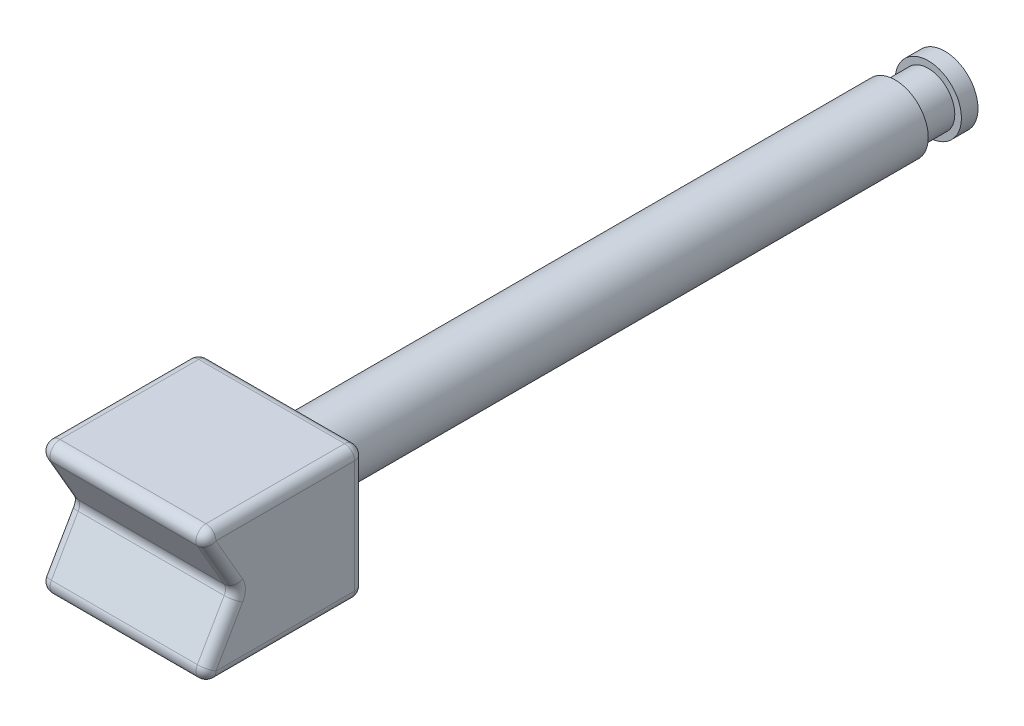
ISO-10303-21;
HEADER;
FILE_DESCRIPTION(('STEP AP214'),'2;1');
FILE_NAME('part.step','',(''),(''),'','','');
FILE_SCHEMA(('AUTOMOTIVE_DESIGN { 1 0 10303 214 1 1 1 1 }'));
ENDSEC;
DATA;
#1=APPLICATION_CONTEXT('core data for automotive mechanical design processes');
#2=APPLICATION_PROTOCOL_DEFINITION('international standard','automotive_design',2000,#1);
#3=PRODUCT_CONTEXT('',#1,'mechanical');
#4=PRODUCT('Part','Part','',(#3));
#5=PRODUCT_RELATED_PRODUCT_CATEGORY('part','',(#4));
#6=PRODUCT_DEFINITION_FORMATION('','',#4);
#7=PRODUCT_DEFINITION_CONTEXT('part definition',#1,'design');
#8=PRODUCT_DEFINITION('design','',#6,#7);
#9=PRODUCT_DEFINITION_SHAPE('','',#8);
#10=(LENGTH_UNIT() NAMED_UNIT(*) SI_UNIT(.MILLI.,.METRE.));
#11=(NAMED_UNIT(*) PLANE_ANGLE_UNIT() SI_UNIT($,.RADIAN.));
#12=(NAMED_UNIT(*) SI_UNIT($,.STERADIAN.) SOLID_ANGLE_UNIT());
#13=UNCERTAINTY_MEASURE_WITH_UNIT(LENGTH_MEASURE(1.E-05),#10,'distance_accuracy_value','');
#14=(GEOMETRIC_REPRESENTATION_CONTEXT(3) GLOBAL_UNCERTAINTY_ASSIGNED_CONTEXT((#13)) GLOBAL_UNIT_ASSIGNED_CONTEXT((#10,
#11,#12)) REPRESENTATION_CONTEXT('',''));
#15=CARTESIAN_POINT('',(0.,0.,0.));
#16=DIRECTION('',(0.,0.,1.));
#17=DIRECTION('',(1.,0.,0.));
#18=AXIS2_PLACEMENT_3D('',#15,#16,#17);
#19=CARTESIAN_POINT('',(0.,0.,-22.5));
#20=DIRECTION('',(0.,0.,1.));
#21=DIRECTION('',(1.,0.,0.));
#22=AXIS2_PLACEMENT_3D('',#19,#20,#21);
#23=CYLINDRICAL_SURFACE('',#22,1.);
#24=CARTESIAN_POINT('',(0.,0.,-2.8));
#25=DIRECTION('',(0.,0.,1.));
#26=DIRECTION('',(1.,0.,0.));
#27=AXIS2_PLACEMENT_3D('',#24,#25,#26);
#28=CIRCLE('',#27,1.);
#29=CARTESIAN_POINT('',(1.,0.,-2.8));
#30=VERTEX_POINT('',#29);
#31=EDGE_CURVE('E179',#30,#30,#28,.F.);
#32=ORIENTED_EDGE('',*,*,#31,.T.);
#33=EDGE_LOOP('',(#32));
#34=FACE_BOUND('',#33,.T.);
#35=CARTESIAN_POINT('',(0.,0.,-21.));
#36=DIRECTION('',(0.,0.,1.));
#37=DIRECTION('',(1.,0.,0.));
#38=AXIS2_PLACEMENT_3D('',#35,#36,#37);
#39=CIRCLE('',#38,1.);
#40=CARTESIAN_POINT('',(1.,0.,-21.));
#41=VERTEX_POINT('',#40);
#42=EDGE_CURVE('E279',#41,#41,#39,.T.);
#43=ORIENTED_EDGE('',*,*,#42,.T.);
#44=EDGE_LOOP('',(#43));
#45=FACE_BOUND('',#44,.T.);
#46=ADVANCED_FACE('F43',(#34,#45),#23,.T.);
#47=CARTESIAN_POINT('',(2.5,2.,2.5));
#48=DIRECTION('',(-1.,0.,0.));
#49=DIRECTION('',(0.,0.,1.));
#50=AXIS2_PLACEMENT_3D('',#47,#48,#49);
#51=PLANE('',#50);
#52=DIRECTION('',(0.,-0.866025403784438,0.500000000000001));
#53=VECTOR('',#52,1.);
#54=CARTESIAN_POINT('',(2.5,0.849999999999994,0.508141571295788));
#55=LINE('',#54,#53);
#56=CARTESIAN_POINT('',(2.5,-0.300000000000001,1.17209438086386));
#57=VERTEX_POINT('',#56);
#58=CARTESIAN_POINT('',(2.5,-1.7,1.98038475772934));
#59=VERTEX_POINT('',#58);
#60=EDGE_CURVE('E385',#57,#59,#55,.T.);
#61=ORIENTED_EDGE('',*,*,#60,.T.);
#62=DIRECTION('',(0.,0.,-1.));
#63=VECTOR('',#62,1.);
#64=CARTESIAN_POINT('',(2.5,-1.7,-2.5));
#65=LINE('',#64,#63);
#66=CARTESIAN_POINT('',(2.5,-1.7,-2.2));
#67=VERTEX_POINT('',#66);
#68=EDGE_CURVE('E388',#59,#67,#65,.T.);
#69=ORIENTED_EDGE('',*,*,#68,.T.);
#70=DIRECTION('',(0.,-1.,0.));
#71=VECTOR('',#70,1.);
#72=CARTESIAN_POINT('',(2.5,2.,-2.2));
#73=LINE('',#72,#71);
#74=CARTESIAN_POINT('',(2.5,1.7,-2.2));
#75=VERTEX_POINT('',#74);
#76=EDGE_CURVE('E378',#67,#75,#73,.F.);
#77=ORIENTED_EDGE('',*,*,#76,.T.);
#78=DIRECTION('',(0.,0.,-1.));
#79=VECTOR('',#78,1.);
#80=CARTESIAN_POINT('',(2.5,1.7,2.5));
#81=LINE('',#80,#79);
#82=CARTESIAN_POINT('',(2.5,1.7,1.98038475772934));
#83=VERTEX_POINT('',#82);
#84=EDGE_CURVE('E372',#75,#83,#81,.F.);
#85=ORIENTED_EDGE('',*,*,#84,.T.);
#86=DIRECTION('',(0.,-0.866025403784438,-0.500000000000001));
#87=VECTOR('',#86,1.);
#88=CARTESIAN_POINT('',(2.5,2.15,2.24019237886467));
#89=LINE('',#88,#87);
#90=CARTESIAN_POINT('',(2.5,0.300000000000001,1.17209438086386));
#91=VERTEX_POINT('',#90);
#92=EDGE_CURVE('E375',#83,#91,#89,.T.);
#93=ORIENTED_EDGE('',*,*,#92,.T.);
#94=CARTESIAN_POINT('',(2.5,0.,1.69170962313452));
#95=DIRECTION('',(-1.,0.,0.));
#96=DIRECTION('',(0.,0.,1.));
#97=AXIS2_PLACEMENT_3D('',#94,#95,#96);
#98=CIRCLE('',#97,0.6);
#99=EDGE_CURVE('E382',#57,#91,#98,.F.);
#100=ORIENTED_EDGE('',*,*,#99,.F.);
#101=EDGE_LOOP('',(#61,#69,#77,#85,#93,#100));
#102=FACE_BOUND('',#101,.T.);
#103=ADVANCED_FACE('F471',(#102),#51,.F.);
#104=CARTESIAN_POINT('',(-2.5,2.,-2.5));
#105=DIRECTION('',(0.,0.,1.));
#106=DIRECTION('',(1.,0.,0.));
#107=AXIS2_PLACEMENT_3D('',#104,#105,#106);
#108=PLANE('',#107);
#109=CARTESIAN_POINT('',(0.,0.,-2.5));
#110=DIRECTION('',(0.,0.,1.));
#111=DIRECTION('',(1.,0.,0.));
#112=AXIS2_PLACEMENT_3D('',#109,#110,#111);
#113=CIRCLE('',#112,1.3);
#114=CARTESIAN_POINT('',(1.3,0.,-2.5));
#115=VERTEX_POINT('',#114);
#116=EDGE_CURVE('E311',#115,#115,#113,.T.);
#117=ORIENTED_EDGE('',*,*,#116,.T.);
#118=EDGE_LOOP('',(#117));
#119=FACE_BOUND('',#118,.T.);
#120=DIRECTION('',(0.,-1.,0.));
#121=VECTOR('',#120,1.);
#122=CARTESIAN_POINT('',(2.2,2.,-2.5));
#123=LINE('',#122,#121);
#124=CARTESIAN_POINT('',(2.2,1.7,-2.5));
#125=VERTEX_POINT('',#124);
#126=CARTESIAN_POINT('',(2.2,-1.7,-2.5));
#127=VERTEX_POINT('',#126);
#128=EDGE_CURVE('E167',#125,#127,#123,.T.);
#129=ORIENTED_EDGE('',*,*,#128,.T.);
#130=DIRECTION('',(-1.,0.,0.));
#131=VECTOR('',#130,1.);
#132=CARTESIAN_POINT('',(-2.5,-1.7,-2.5));
#133=LINE('',#132,#131);
#134=CARTESIAN_POINT('',(-2.2,-1.7,-2.5));
#135=VERTEX_POINT('',#134);
#136=EDGE_CURVE('E162',#127,#135,#133,.T.);
#137=ORIENTED_EDGE('',*,*,#136,.T.);
#138=DIRECTION('',(0.,-1.,0.));
#139=VECTOR('',#138,1.);
#140=CARTESIAN_POINT('',(-2.2,2.,-2.5));
#141=LINE('',#140,#139);
#142=CARTESIAN_POINT('',(-2.2,1.7,-2.5));
#143=VERTEX_POINT('',#142);
#144=EDGE_CURVE('E156',#135,#143,#141,.F.);
#145=ORIENTED_EDGE('',*,*,#144,.T.);
#146=DIRECTION('',(-1.,0.,0.));
#147=VECTOR('',#146,1.);
#148=CARTESIAN_POINT('',(-2.5,1.7,-2.5));
#149=LINE('',#148,#147);
#150=EDGE_CURVE('E159',#143,#125,#149,.F.);
#151=ORIENTED_EDGE('',*,*,#150,.T.);
#152=EDGE_LOOP('',(#129,#137,#145,#151));
#153=FACE_BOUND('',#152,.T.);
#154=ADVANCED_FACE('F158',(#119,#153),#108,.F.);
#155=CARTESIAN_POINT('',(-2.5,2.,2.5));
#156=DIRECTION('',(1.,0.,0.));
#157=DIRECTION('',(0.,0.,-1.));
#158=AXIS2_PLACEMENT_3D('',#155,#156,#157);
#159=PLANE('',#158);
#160=DIRECTION('',(0.,-1.,0.));
#161=VECTOR('',#160,1.);
#162=CARTESIAN_POINT('',(-2.5,2.,-2.2));
#163=LINE('',#162,#161);
#164=CARTESIAN_POINT('',(-2.5,1.7,-2.2));
#165=VERTEX_POINT('',#164);
#166=CARTESIAN_POINT('',(-2.5,-1.7,-2.2));
#167=VERTEX_POINT('',#166);
#168=EDGE_CURVE('E192',#165,#167,#163,.T.);
#169=ORIENTED_EDGE('',*,*,#168,.T.);
#170=DIRECTION('',(0.,0.,1.));
#171=VECTOR('',#170,1.);
#172=CARTESIAN_POINT('',(-2.5,-1.7,2.5));
#173=LINE('',#172,#171);
#174=CARTESIAN_POINT('',(-2.5,-1.7,1.98038475772934));
#175=VERTEX_POINT('',#174);
#176=EDGE_CURVE('E343',#167,#175,#173,.T.);
#177=ORIENTED_EDGE('',*,*,#176,.T.);
#178=DIRECTION('',(0.,-0.866025403784438,0.500000000000001));
#179=VECTOR('',#178,1.);
#180=CARTESIAN_POINT('',(-2.5,0.849999999999995,0.50814157129579));
#181=LINE('',#180,#179);
#182=CARTESIAN_POINT('',(-2.5,-0.300000000000001,1.17209438086386));
#183=VERTEX_POINT('',#182);
#184=EDGE_CURVE('E340',#175,#183,#181,.F.);
#185=ORIENTED_EDGE('',*,*,#184,.T.);
#186=CARTESIAN_POINT('',(-2.5,0.,1.69170962313452));
#187=DIRECTION('',(1.,0.,0.));
#188=DIRECTION('',(0.,0.,-1.));
#189=AXIS2_PLACEMENT_3D('',#186,#187,#188);
#190=CIRCLE('',#189,0.6);
#191=CARTESIAN_POINT('',(-2.5,0.300000000000001,1.17209438086386));
#192=VERTEX_POINT('',#191);
#193=EDGE_CURVE('E336',#192,#183,#190,.F.);
#194=ORIENTED_EDGE('',*,*,#193,.F.);
#195=DIRECTION('',(0.,-0.866025403784438,-0.500000000000001));
#196=VECTOR('',#195,1.);
#197=CARTESIAN_POINT('',(-2.5,2.15,2.24019237886467));
#198=LINE('',#197,#196);
#199=CARTESIAN_POINT('',(-2.5,1.7,1.98038475772934));
#200=VERTEX_POINT('',#199);
#201=EDGE_CURVE('E331',#192,#200,#198,.F.);
#202=ORIENTED_EDGE('',*,*,#201,.T.);
#203=DIRECTION('',(0.,0.,1.));
#204=VECTOR('',#203,1.);
#205=CARTESIAN_POINT('',(-2.5,1.7,2.5));
#206=LINE('',#205,#204);
#207=EDGE_CURVE('E328',#200,#165,#206,.F.);
#208=ORIENTED_EDGE('',*,*,#207,.T.);
#209=EDGE_LOOP('',(#169,#177,#185,#194,#202,#208));
#210=FACE_BOUND('',#209,.T.);
#211=ADVANCED_FACE('F443',(#210),#159,.F.);
#212=CARTESIAN_POINT('',(0.,2.,0.));
#213=DIRECTION('',(0.,-1.,0.));
#214=DIRECTION('',(0.,0.,-1.));
#215=AXIS2_PLACEMENT_3D('',#212,#213,#214);
#216=PLANE('',#215);
#217=DIRECTION('',(0.,0.,1.));
#218=VECTOR('',#217,1.);
#219=CARTESIAN_POINT('',(-2.2,2.,0.));
#220=LINE('',#219,#218);
#221=CARTESIAN_POINT('',(-2.2,2.,-2.2));
#222=VERTEX_POINT('',#221);
#223=CARTESIAN_POINT('',(-2.2,2.,1.98038475772934));
#224=VERTEX_POINT('',#223);
#225=EDGE_CURVE('E53',#222,#224,#220,.T.);
#226=ORIENTED_EDGE('',*,*,#225,.T.);
#227=DIRECTION('',(1.,0.,0.));
#228=VECTOR('',#227,1.);
#229=CARTESIAN_POINT('',(0.,2.,1.98038475772934));
#230=LINE('',#229,#228);
#231=CARTESIAN_POINT('',(2.2,2.,1.98038475772934));
#232=VERTEX_POINT('',#231);
#233=EDGE_CURVE('E11',#224,#232,#230,.T.);
#234=ORIENTED_EDGE('',*,*,#233,.T.);
#235=DIRECTION('',(0.,0.,-1.));
#236=VECTOR('',#235,1.);
#237=CARTESIAN_POINT('',(2.2,2.,0.));
#238=LINE('',#237,#236);
#239=CARTESIAN_POINT('',(2.2,2.,-2.2));
#240=VERTEX_POINT('',#239);
#241=EDGE_CURVE('E391',#232,#240,#238,.T.);
#242=ORIENTED_EDGE('',*,*,#241,.T.);
#243=DIRECTION('',(-1.,0.,0.));
#244=VECTOR('',#243,1.);
#245=CARTESIAN_POINT('',(0.,2.,-2.2));
#246=LINE('',#245,#244);
#247=EDGE_CURVE('E64',#240,#222,#246,.T.);
#248=ORIENTED_EDGE('',*,*,#247,.T.);
#249=EDGE_LOOP('',(#226,#234,#242,#248));
#250=FACE_BOUND('',#249,.T.);
#251=ADVANCED_FACE('F458',(#250),#216,.F.);
#252=CARTESIAN_POINT('',(0.,-2.,0.));
#253=DIRECTION('',(0.,-1.,0.));
#254=DIRECTION('',(0.,0.,-1.));
#255=AXIS2_PLACEMENT_3D('',#252,#253,#254);
#256=PLANE('',#255);
#257=DIRECTION('',(0.,0.,1.));
#258=VECTOR('',#257,1.);
#259=CARTESIAN_POINT('',(-2.2,-2.,-2.5));
#260=LINE('',#259,#258);
#261=CARTESIAN_POINT('',(-2.2,-2.,1.98038475772934));
#262=VERTEX_POINT('',#261);
#263=CARTESIAN_POINT('',(-2.2,-2.,-2.2));
#264=VERTEX_POINT('',#263);
#265=EDGE_CURVE('E321',#262,#264,#260,.F.);
#266=ORIENTED_EDGE('',*,*,#265,.T.);
#267=DIRECTION('',(-1.,0.,0.));
#268=VECTOR('',#267,1.);
#269=CARTESIAN_POINT('',(2.5,-2.,-2.2));
#270=LINE('',#269,#268);
#271=CARTESIAN_POINT('',(2.2,-2.,-2.2));
#272=VERTEX_POINT('',#271);
#273=EDGE_CURVE('E324',#264,#272,#270,.F.);
#274=ORIENTED_EDGE('',*,*,#273,.T.);
#275=DIRECTION('',(0.,0.,-1.));
#276=VECTOR('',#275,1.);
#277=CARTESIAN_POINT('',(2.2,-2.,2.5));
#278=LINE('',#277,#276);
#279=CARTESIAN_POINT('',(2.2,-2.,1.98038475772934));
#280=VERTEX_POINT('',#279);
#281=EDGE_CURVE('E315',#272,#280,#278,.F.);
#282=ORIENTED_EDGE('',*,*,#281,.T.);
#283=DIRECTION('',(1.,0.,0.));
#284=VECTOR('',#283,1.);
#285=CARTESIAN_POINT('',(-2.5,-2.,1.98038475772934));
#286=LINE('',#285,#284);
#287=EDGE_CURVE('E318',#280,#262,#286,.F.);
#288=ORIENTED_EDGE('',*,*,#287,.T.);
#289=EDGE_LOOP('',(#266,#274,#282,#288));
#290=FACE_BOUND('',#289,.T.);
#291=ADVANCED_FACE('F429',(#290),#256,.T.);
#292=CARTESIAN_POINT('',(2.5,0.,1.34529946162074));
#293=DIRECTION('',(0.,-0.500000000000001,-0.866025403784438));
#294=DIRECTION('',(0.,0.866025403784438,-0.500000000000001));
#295=AXIS2_PLACEMENT_3D('',#292,#293,#294);
#296=PLANE('',#295);
#297=DIRECTION('',(-1.,0.,0.));
#298=VECTOR('',#297,1.);
#299=CARTESIAN_POINT('',(-2.5,-0.150000000000001,1.43190200199919));
#300=LINE('',#299,#298);
#301=CARTESIAN_POINT('',(2.2,-0.150000000000001,1.43190200199919));
#302=VERTEX_POINT('',#301);
#303=CARTESIAN_POINT('',(-2.2,-0.150000000000001,1.43190200199919));
#304=VERTEX_POINT('',#303);
#305=EDGE_CURVE('E365',#302,#304,#300,.T.);
#306=ORIENTED_EDGE('',*,*,#305,.T.);
#307=DIRECTION('',(0.,-0.866025403784438,0.500000000000001));
#308=VECTOR('',#307,1.);
#309=CARTESIAN_POINT('',(-2.2,0.,1.34529946162075));
#310=LINE('',#309,#308);
#311=CARTESIAN_POINT('',(-2.2,-1.55,2.24019237886467));
#312=VERTEX_POINT('',#311);
#313=EDGE_CURVE('E369',#304,#312,#310,.T.);
#314=ORIENTED_EDGE('',*,*,#313,.T.);
#315=DIRECTION('',(1.,0.,0.));
#316=VECTOR('',#315,1.);
#317=CARTESIAN_POINT('',(2.5,-1.55,2.24019237886467));
#318=LINE('',#317,#316);
#319=CARTESIAN_POINT('',(2.2,-1.55,2.24019237886467));
#320=VERTEX_POINT('',#319);
#321=EDGE_CURVE('E362',#312,#320,#318,.T.);
#322=ORIENTED_EDGE('',*,*,#321,.T.);
#323=DIRECTION('',(0.,-0.866025403784438,0.500000000000001));
#324=VECTOR('',#323,1.);
#325=CARTESIAN_POINT('',(2.2,0.,1.34529946162074));
#326=LINE('',#325,#324);
#327=EDGE_CURVE('E359',#320,#302,#326,.F.);
#328=ORIENTED_EDGE('',*,*,#327,.T.);
#329=EDGE_LOOP('',(#306,#314,#322,#328));
#330=FACE_BOUND('',#329,.T.);
#331=ADVANCED_FACE('F561',(#330),#296,.F.);
#332=CARTESIAN_POINT('',(2.5,2.,2.5));
#333=DIRECTION('',(0.,0.500000000000001,-0.866025403784438));
#334=DIRECTION('',(0.,0.866025403784438,0.500000000000001));
#335=AXIS2_PLACEMENT_3D('',#332,#333,#334);
#336=PLANE('',#335);
#337=DIRECTION('',(1.,0.,0.));
#338=VECTOR('',#337,1.);
#339=CARTESIAN_POINT('',(2.5,1.55,2.24019237886467));
#340=LINE('',#339,#338);
#341=CARTESIAN_POINT('',(2.2,1.55,2.24019237886467));
#342=VERTEX_POINT('',#341);
#343=CARTESIAN_POINT('',(-2.2,1.55,2.24019237886467));
#344=VERTEX_POINT('',#343);
#345=EDGE_CURVE('E346',#342,#344,#340,.F.);
#346=ORIENTED_EDGE('',*,*,#345,.T.);
#347=DIRECTION('',(0.,-0.866025403784438,-0.500000000000001));
#348=VECTOR('',#347,1.);
#349=CARTESIAN_POINT('',(-2.2,2.,2.5));
#350=LINE('',#349,#348);
#351=CARTESIAN_POINT('',(-2.2,0.15,1.43190200199919));
#352=VERTEX_POINT('',#351);
#353=EDGE_CURVE('E355',#344,#352,#350,.T.);
#354=ORIENTED_EDGE('',*,*,#353,.T.);
#355=DIRECTION('',(-1.,0.,0.));
#356=VECTOR('',#355,1.);
#357=CARTESIAN_POINT('',(2.5,0.15,1.43190200199919));
#358=LINE('',#357,#356);
#359=CARTESIAN_POINT('',(2.2,0.15,1.43190200199919));
#360=VERTEX_POINT('',#359);
#361=EDGE_CURVE('E352',#352,#360,#358,.F.);
#362=ORIENTED_EDGE('',*,*,#361,.T.);
#363=DIRECTION('',(0.,-0.866025403784438,-0.500000000000001));
#364=VECTOR('',#363,1.);
#365=CARTESIAN_POINT('',(2.2,2.,2.5));
#366=LINE('',#365,#364);
#367=EDGE_CURVE('E349',#360,#342,#366,.F.);
#368=ORIENTED_EDGE('',*,*,#367,.T.);
#369=EDGE_LOOP('',(#346,#354,#362,#368));
#370=FACE_BOUND('',#369,.T.);
#371=ADVANCED_FACE('F504',(#370),#336,.F.);
#372=CARTESIAN_POINT('',(0.,1.,-21.));
#373=DIRECTION('',(0.,0.,-1.));
#374=DIRECTION('',(-1.,0.,0.));
#375=AXIS2_PLACEMENT_3D('',#372,#373,#374);
#376=PLANE('',#375);
#377=CARTESIAN_POINT('',(0.,0.,-21.));
#378=DIRECTION('',(0.,0.,1.));
#379=DIRECTION('',(1.,0.,0.));
#380=AXIS2_PLACEMENT_3D('',#377,#378,#379);
#381=CIRCLE('',#380,0.8);
#382=CARTESIAN_POINT('',(0.8,0.,-21.));
#383=VERTEX_POINT('',#382);
#384=EDGE_CURVE('E296',#383,#383,#381,.T.);
#385=ORIENTED_EDGE('',*,*,#384,.T.);
#386=EDGE_LOOP('',(#385));
#387=FACE_BOUND('',#386,.T.);
#388=ORIENTED_EDGE('',*,*,#42,.F.);
#389=EDGE_LOOP('',(#388));
#390=FACE_BOUND('',#389,.T.);
#391=ADVANCED_FACE('F551',(#387,#390),#376,.T.);
#392=CARTESIAN_POINT('',(0.,0.,-23.5));
#393=DIRECTION('',(0.,0.,1.));
#394=DIRECTION('',(1.,0.,0.));
#395=AXIS2_PLACEMENT_3D('',#392,#393,#394);
#396=CYLINDRICAL_SURFACE('',#395,0.8);
#397=CARTESIAN_POINT('',(0.,0.,-22.));
#398=DIRECTION('',(0.,0.,1.));
#399=DIRECTION('',(1.,0.,0.));
#400=AXIS2_PLACEMENT_3D('',#397,#398,#399);
#401=CIRCLE('',#400,0.8);
#402=CARTESIAN_POINT('',(0.8,0.,-22.));
#403=VERTEX_POINT('',#402);
#404=EDGE_CURVE('E290',#403,#403,#401,.T.);
#405=ORIENTED_EDGE('',*,*,#404,.T.);
#406=EDGE_LOOP('',(#405));
#407=FACE_BOUND('',#406,.T.);
#408=ORIENTED_EDGE('',*,*,#384,.F.);
#409=EDGE_LOOP('',(#408));
#410=FACE_BOUND('',#409,.T.);
#411=ADVANCED_FACE('F545',(#407,#410),#396,.T.);
#412=CARTESIAN_POINT('',(0.,0.999999999999999,-22.));
#413=DIRECTION('',(0.,0.,1.));
#414=DIRECTION('',(1.,0.,0.));
#415=AXIS2_PLACEMENT_3D('',#412,#413,#414);
#416=PLANE('',#415);
#417=CARTESIAN_POINT('',(0.,0.,-22.));
#418=DIRECTION('',(0.,0.,1.));
#419=DIRECTION('',(1.,0.,0.));
#420=AXIS2_PLACEMENT_3D('',#417,#418,#419);
#421=CIRCLE('',#420,0.999999999999999);
#422=CARTESIAN_POINT('',(0.999999999999999,0.,-22.));
#423=VERTEX_POINT('',#422);
#424=EDGE_CURVE('E284',#423,#423,#421,.T.);
#425=ORIENTED_EDGE('',*,*,#424,.T.);
#426=EDGE_LOOP('',(#425));
#427=FACE_BOUND('',#426,.T.);
#428=ORIENTED_EDGE('',*,*,#404,.F.);
#429=EDGE_LOOP('',(#428));
#430=FACE_BOUND('',#429,.T.);
#431=ADVANCED_FACE('F537',(#427,#430),#416,.T.);
#432=CARTESIAN_POINT('',(0.,0.,-22.5));
#433=DIRECTION('',(0.,0.,-1.));
#434=DIRECTION('',(-1.,0.,0.));
#435=AXIS2_PLACEMENT_3D('',#432,#433,#434);
#436=PLANE('',#435);
#437=CARTESIAN_POINT('',(0.,0.,-22.5));
#438=DIRECTION('',(0.,0.,-1.));
#439=DIRECTION('',(-1.,0.,0.));
#440=AXIS2_PLACEMENT_3D('',#437,#438,#439);
#441=CIRCLE('',#440,1.);
#442=CARTESIAN_POINT('',(-1.,0.,-22.5));
#443=VERTEX_POINT('',#442);
#444=EDGE_CURVE('E300',#443,#443,#441,.T.);
#445=ORIENTED_EDGE('',*,*,#444,.T.);
#446=EDGE_LOOP('',(#445));
#447=FACE_BOUND('',#446,.T.);
#448=ADVANCED_FACE('F529',(#447),#436,.T.);
#449=ORIENTED_EDGE('',*,*,#444,.F.);
#450=EDGE_LOOP('',(#449));
#451=FACE_BOUND('',#450,.T.);
#452=ORIENTED_EDGE('',*,*,#424,.F.);
#453=EDGE_LOOP('',(#452));
#454=FACE_BOUND('',#453,.T.);
#455=ADVANCED_FACE('F520',(#451,#454),#23,.T.);
#456=CARTESIAN_POINT('',(0.,0.,-2.8));
#457=DIRECTION('',(0.,0.,1.));
#458=DIRECTION('',(1.,0.,0.));
#459=AXIS2_PLACEMENT_3D('',#456,#457,#458);
#460=TOROIDAL_SURFACE('',#459,1.3,0.3);
#461=ORIENTED_EDGE('',*,*,#116,.F.);
#462=EDGE_LOOP('',(#461));
#463=FACE_BOUND('',#462,.T.);
#464=ORIENTED_EDGE('',*,*,#31,.F.);
#465=EDGE_LOOP('',(#464));
#466=FACE_BOUND('',#465,.T.);
#467=ADVANCED_FACE('F528',(#463,#466),#460,.F.);
#468=CARTESIAN_POINT('',(2.2,2.15,2.24019237886467));
#469=DIRECTION('',(0.,-0.866025403784438,-0.500000000000001));
#470=DIRECTION('',(0.,0.500000000000001,-0.866025403784438));
#471=AXIS2_PLACEMENT_3D('',#468,#469,#470);
#472=CYLINDRICAL_SURFACE('',#471,0.3);
#473=CARTESIAN_POINT('',(2.2,1.7,1.98038475772934));
#474=DIRECTION('',(0.,0.866025403784438,0.500000000000001));
#475=DIRECTION('',(0.,-0.500000000000001,0.866025403784438));
#476=AXIS2_PLACEMENT_3D('',#473,#474,#475);
#477=CIRCLE('',#476,0.3);
#478=EDGE_CURVE('E268',#342,#83,#477,.T.);
#479=ORIENTED_EDGE('',*,*,#478,.F.);
#480=ORIENTED_EDGE('',*,*,#367,.F.);
#481=CARTESIAN_POINT('',(2.2,0.300000000000001,1.17209438086386));
#482=DIRECTION('',(0.,-0.866025403784438,-0.500000000000001));
#483=DIRECTION('',(0.,0.500000000000001,-0.866025403784438));
#484=AXIS2_PLACEMENT_3D('',#481,#482,#483);
#485=CIRCLE('',#484,0.3);
#486=EDGE_CURVE('E271',#91,#360,#485,.T.);
#487=ORIENTED_EDGE('',*,*,#486,.F.);
#488=ORIENTED_EDGE('',*,*,#92,.F.);
#489=EDGE_LOOP('',(#479,#480,#487,#488));
#490=FACE_BOUND('',#489,.T.);
#491=ADVANCED_FACE('F45',(#490),#472,.T.);
#492=CARTESIAN_POINT('',(0.,1.7,1.98038475772934));
#493=DIRECTION('',(1.,0.,0.));
#494=DIRECTION('',(0.,0.,-1.));
#495=AXIS2_PLACEMENT_3D('',#492,#493,#494);
#496=CYLINDRICAL_SURFACE('',#495,0.3);
#497=CARTESIAN_POINT('',(-2.2,1.7,1.98038475772934));
#498=DIRECTION('',(-1.,0.,0.));
#499=DIRECTION('',(0.,-1.,0.));
#500=AXIS2_PLACEMENT_3D('',#497,#498,#499);
#501=CIRCLE('',#500,0.3);
#502=EDGE_CURVE('E260',#344,#224,#501,.T.);
#503=ORIENTED_EDGE('',*,*,#502,.F.);
#504=ORIENTED_EDGE('',*,*,#345,.F.);
#505=CARTESIAN_POINT('',(2.2,1.7,1.98038475772934));
#506=DIRECTION('',(1.,0.,0.));
#507=DIRECTION('',(0.,0.,-1.));
#508=AXIS2_PLACEMENT_3D('',#505,#506,#507);
#509=CIRCLE('',#508,0.3);
#510=EDGE_CURVE('E264',#232,#342,#509,.T.);
#511=ORIENTED_EDGE('',*,*,#510,.F.);
#512=ORIENTED_EDGE('',*,*,#233,.F.);
#513=EDGE_LOOP('',(#503,#504,#511,#512));
#514=FACE_BOUND('',#513,.T.);
#515=ADVANCED_FACE('F455',(#514),#496,.T.);
#516=CARTESIAN_POINT('',(-2.2,2.15,2.24019237886467));
#517=DIRECTION('',(0.,-0.866025403784438,-0.500000000000001));
#518=DIRECTION('',(0.,0.500000000000001,-0.866025403784438));
#519=AXIS2_PLACEMENT_3D('',#516,#517,#518);
#520=CYLINDRICAL_SURFACE('',#519,0.3);
#521=CARTESIAN_POINT('',(-2.2,0.300000000000001,1.17209438086386));
#522=DIRECTION('',(0.,-0.866025403784438,-0.500000000000001));
#523=DIRECTION('',(0.,0.500000000000001,-0.866025403784438));
#524=AXIS2_PLACEMENT_3D('',#521,#522,#523);
#525=CIRCLE('',#524,0.3);
#526=EDGE_CURVE('E252',#352,#192,#525,.T.);
#527=ORIENTED_EDGE('',*,*,#526,.F.);
#528=ORIENTED_EDGE('',*,*,#353,.F.);
#529=CARTESIAN_POINT('',(-2.2,1.7,1.98038475772934));
#530=DIRECTION('',(0.,0.866025403784438,0.500000000000001));
#531=DIRECTION('',(0.,-0.500000000000001,0.866025403784438));
#532=AXIS2_PLACEMENT_3D('',#529,#530,#531);
#533=CIRCLE('',#532,0.3);
#534=EDGE_CURVE('E256',#200,#344,#533,.T.);
#535=ORIENTED_EDGE('',*,*,#534,.F.);
#536=ORIENTED_EDGE('',*,*,#201,.F.);
#537=EDGE_LOOP('',(#527,#528,#535,#536));
#538=FACE_BOUND('',#537,.T.);
#539=ADVANCED_FACE('F498',(#538),#520,.T.);
#540=CARTESIAN_POINT('',(2.5,0.,1.69170962313452));
#541=DIRECTION('',(1.,0.,0.));
#542=DIRECTION('',(0.,0.,-1.));
#543=AXIS2_PLACEMENT_3D('',#540,#541,#542);
#544=CYLINDRICAL_SURFACE('',#543,0.3);
#545=CARTESIAN_POINT('',(2.2,0.,1.69170962313452));
#546=DIRECTION('',(-1.,0.,0.));
#547=DIRECTION('',(0.,0.,1.));
#548=AXIS2_PLACEMENT_3D('',#545,#546,#547);
#549=CIRCLE('',#548,0.3);
#550=EDGE_CURVE('E47',#360,#302,#549,.T.);
#551=ORIENTED_EDGE('',*,*,#550,.F.);
#552=ORIENTED_EDGE('',*,*,#361,.F.);
#553=CARTESIAN_POINT('',(-2.2,0.,1.69170962313452));
#554=DIRECTION('',(1.,0.,0.));
#555=DIRECTION('',(0.,0.,-1.));
#556=AXIS2_PLACEMENT_3D('',#553,#554,#555);
#557=CIRCLE('',#556,0.3);
#558=EDGE_CURVE('E249',#304,#352,#557,.T.);
#559=ORIENTED_EDGE('',*,*,#558,.F.);
#560=ORIENTED_EDGE('',*,*,#305,.F.);
#561=EDGE_LOOP('',(#551,#552,#559,#560));
#562=FACE_BOUND('',#561,.T.);
#563=ADVANCED_FACE('F500',(#562),#544,.F.);
#564=CARTESIAN_POINT('',(2.2,0.,1.69170962313452));
#565=DIRECTION('',(-1.,0.,0.));
#566=DIRECTION('',(0.,0.,1.));
#567=AXIS2_PLACEMENT_3D('',#564,#565,#566);
#568=TOROIDAL_SURFACE('',#567,0.6,0.3);
#569=ORIENTED_EDGE('',*,*,#486,.T.);
#570=ORIENTED_EDGE('',*,*,#550,.T.);
#571=CARTESIAN_POINT('',(2.2,-0.300000000000001,1.17209438086386));
#572=DIRECTION('',(0.,0.866025403784438,-0.500000000000001));
#573=DIRECTION('',(0.,0.500000000000001,0.866025403784438));
#574=AXIS2_PLACEMENT_3D('',#571,#572,#573);
#575=CIRCLE('',#574,0.3);
#576=EDGE_CURVE('E245',#57,#302,#575,.F.);
#577=ORIENTED_EDGE('',*,*,#576,.F.);
#578=ORIENTED_EDGE('',*,*,#99,.T.);
#579=EDGE_LOOP('',(#569,#570,#577,#578));
#580=FACE_BOUND('',#579,.T.);
#581=ADVANCED_FACE('F509',(#580),#568,.T.);
#582=CARTESIAN_POINT('',(2.2,1.7,1.98038475772934));
#583=DIRECTION('',(1.,0.,0.));
#584=DIRECTION('',(0.,0.,-1.));
#585=AXIS2_PLACEMENT_3D('',#582,#583,#584);
#586=SPHERICAL_SURFACE('',#585,0.3);
#587=ORIENTED_EDGE('',*,*,#510,.T.);
#588=ORIENTED_EDGE('',*,*,#478,.T.);
#589=CARTESIAN_POINT('',(2.2,1.7,1.98038475772934));
#590=DIRECTION('',(0.,0.,1.));
#591=DIRECTION('',(1.,0.,0.));
#592=AXIS2_PLACEMENT_3D('',#589,#590,#591);
#593=CIRCLE('',#592,0.3);
#594=EDGE_CURVE('E241',#232,#83,#593,.F.);
#595=ORIENTED_EDGE('',*,*,#594,.F.);
#596=EDGE_LOOP('',(#587,#588,#595));
#597=FACE_BOUND('',#596,.T.);
#598=ADVANCED_FACE('F507',(#597),#586,.T.);
#599=CARTESIAN_POINT('',(-2.2,1.7,1.98038475772934));
#600=DIRECTION('',(-1.,0.,0.));
#601=DIRECTION('',(0.,0.,1.));
#602=AXIS2_PLACEMENT_3D('',#599,#600,#601);
#603=SPHERICAL_SURFACE('',#602,0.3);
#604=ORIENTED_EDGE('',*,*,#534,.T.);
#605=ORIENTED_EDGE('',*,*,#502,.T.);
#606=CARTESIAN_POINT('',(-2.2,1.7,1.98038475772934));
#607=DIRECTION('',(0.,0.,1.));
#608=DIRECTION('',(1.,0.,0.));
#609=AXIS2_PLACEMENT_3D('',#606,#607,#608);
#610=CIRCLE('',#609,0.3);
#611=EDGE_CURVE('E237',#200,#224,#610,.F.);
#612=ORIENTED_EDGE('',*,*,#611,.F.);
#613=EDGE_LOOP('',(#604,#605,#612));
#614=FACE_BOUND('',#613,.T.);
#615=ADVANCED_FACE('F451',(#614),#603,.T.);
#616=CARTESIAN_POINT('',(-2.2,0.,1.69170962313452));
#617=DIRECTION('',(1.,0.,0.));
#618=DIRECTION('',(0.,0.,-1.));
#619=AXIS2_PLACEMENT_3D('',#616,#617,#618);
#620=TOROIDAL_SURFACE('',#619,0.6,0.3);
#621=ORIENTED_EDGE('',*,*,#526,.T.);
#622=ORIENTED_EDGE('',*,*,#193,.T.);
#623=CARTESIAN_POINT('',(-2.2,-0.300000000000001,1.17209438086386));
#624=DIRECTION('',(0.,0.866025403784438,-0.500000000000002));
#625=DIRECTION('',(0.,0.500000000000002,0.866025403784438));
#626=AXIS2_PLACEMENT_3D('',#623,#624,#625);
#627=CIRCLE('',#626,0.3);
#628=EDGE_CURVE('E233',#304,#183,#627,.F.);
#629=ORIENTED_EDGE('',*,*,#628,.F.);
#630=ORIENTED_EDGE('',*,*,#558,.T.);
#631=EDGE_LOOP('',(#621,#622,#629,#630));
#632=FACE_BOUND('',#631,.T.);
#633=ADVANCED_FACE('F492',(#632),#620,.T.);
#634=CARTESIAN_POINT('',(2.2,0.849999999999994,0.508141571295789));
#635=DIRECTION('',(0.,-0.866025403784438,0.500000000000001));
#636=DIRECTION('',(0.,-0.500000000000001,-0.866025403784438));
#637=AXIS2_PLACEMENT_3D('',#634,#635,#636);
#638=CYLINDRICAL_SURFACE('',#637,0.3);
#639=ORIENTED_EDGE('',*,*,#576,.T.);
#640=ORIENTED_EDGE('',*,*,#327,.F.);
#641=CARTESIAN_POINT('',(2.2,-1.7,1.98038475772934));
#642=DIRECTION('',(0.,-0.866025403784438,0.500000000000001));
#643=DIRECTION('',(0.,-0.500000000000001,-0.866025403784438));
#644=AXIS2_PLACEMENT_3D('',#641,#642,#643);
#645=CIRCLE('',#644,0.3);
#646=EDGE_CURVE('E225',#59,#320,#645,.T.);
#647=ORIENTED_EDGE('',*,*,#646,.F.);
#648=ORIENTED_EDGE('',*,*,#60,.F.);
#649=EDGE_LOOP('',(#639,#640,#647,#648));
#650=FACE_BOUND('',#649,.T.);
#651=ADVANCED_FACE('F477',(#650),#638,.T.);
#652=CARTESIAN_POINT('',(2.2,1.7,0.));
#653=DIRECTION('',(0.,0.,-1.));
#654=DIRECTION('',(-1.,0.,0.));
#655=AXIS2_PLACEMENT_3D('',#652,#653,#654);
#656=CYLINDRICAL_SURFACE('',#655,0.3);
#657=ORIENTED_EDGE('',*,*,#594,.T.);
#658=ORIENTED_EDGE('',*,*,#84,.F.);
#659=CARTESIAN_POINT('',(2.2,1.7,-2.2));
#660=DIRECTION('',(0.,0.,-1.));
#661=DIRECTION('',(-1.,0.,0.));
#662=AXIS2_PLACEMENT_3D('',#659,#660,#661);
#663=CIRCLE('',#662,0.3);
#664=EDGE_CURVE('E221',#240,#75,#663,.T.);
#665=ORIENTED_EDGE('',*,*,#664,.F.);
#666=ORIENTED_EDGE('',*,*,#241,.F.);
#667=EDGE_LOOP('',(#657,#658,#665,#666));
#668=FACE_BOUND('',#667,.T.);
#669=ADVANCED_FACE('F463',(#668),#656,.T.);
#670=CARTESIAN_POINT('',(0.,1.7,-2.2));
#671=DIRECTION('',(-1.,0.,0.));
#672=DIRECTION('',(0.,0.,1.));
#673=AXIS2_PLACEMENT_3D('',#670,#671,#672);
#674=CYLINDRICAL_SURFACE('',#673,0.3);
#675=CARTESIAN_POINT('',(-2.2,1.7,-2.2));
#676=DIRECTION('',(-1.,0.,0.));
#677=DIRECTION('',(0.,0.,1.));
#678=AXIS2_PLACEMENT_3D('',#675,#676,#677);
#679=CIRCLE('',#678,0.3);
#680=EDGE_CURVE('E173',#222,#143,#679,.T.);
#681=ORIENTED_EDGE('',*,*,#680,.F.);
#682=ORIENTED_EDGE('',*,*,#247,.F.);
#683=CARTESIAN_POINT('',(2.2,1.7,-2.2));
#684=DIRECTION('',(1.,0.,0.));
#685=DIRECTION('',(0.,0.,-1.));
#686=AXIS2_PLACEMENT_3D('',#683,#684,#685);
#687=CIRCLE('',#686,0.3);
#688=EDGE_CURVE('E176',#125,#240,#687,.T.);
#689=ORIENTED_EDGE('',*,*,#688,.F.);
#690=ORIENTED_EDGE('',*,*,#150,.F.);
#691=EDGE_LOOP('',(#681,#682,#689,#690));
#692=FACE_BOUND('',#691,.T.);
#693=ADVANCED_FACE('F172',(#692),#674,.T.);
#694=CARTESIAN_POINT('',(-2.2,1.7,0.));
#695=DIRECTION('',(0.,0.,1.));
#696=DIRECTION('',(1.,0.,0.));
#697=AXIS2_PLACEMENT_3D('',#694,#695,#696);
#698=CYLINDRICAL_SURFACE('',#697,0.3);
#699=ORIENTED_EDGE('',*,*,#611,.T.);
#700=ORIENTED_EDGE('',*,*,#225,.F.);
#701=CARTESIAN_POINT('',(-2.2,1.7,-2.2));
#702=DIRECTION('',(0.,0.,-1.));
#703=DIRECTION('',(-1.,0.,0.));
#704=AXIS2_PLACEMENT_3D('',#701,#702,#703);
#705=CIRCLE('',#704,0.3);
#706=EDGE_CURVE('E187',#165,#222,#705,.T.);
#707=ORIENTED_EDGE('',*,*,#706,.F.);
#708=ORIENTED_EDGE('',*,*,#207,.F.);
#709=EDGE_LOOP('',(#699,#700,#707,#708));
#710=FACE_BOUND('',#709,.T.);
#711=ADVANCED_FACE('F448',(#710),#698,.T.);
#712=CARTESIAN_POINT('',(-2.2,-0.15,1.08549184048541));
#713=DIRECTION('',(0.,-0.866025403784438,0.500000000000001));
#714=DIRECTION('',(0.,-0.500000000000001,-0.866025403784438));
#715=AXIS2_PLACEMENT_3D('',#712,#713,#714);
#716=CYLINDRICAL_SURFACE('',#715,0.3);
#717=ORIENTED_EDGE('',*,*,#628,.T.);
#718=ORIENTED_EDGE('',*,*,#184,.F.);
#719=CARTESIAN_POINT('',(-2.2,-1.7,1.98038475772934));
#720=DIRECTION('',(0.,-0.866025403784438,0.500000000000001));
#721=DIRECTION('',(0.,-0.500000000000001,-0.866025403784438));
#722=AXIS2_PLACEMENT_3D('',#719,#720,#721);
#723=CIRCLE('',#722,0.3);
#724=EDGE_CURVE('E213',#312,#175,#723,.T.);
#725=ORIENTED_EDGE('',*,*,#724,.F.);
#726=ORIENTED_EDGE('',*,*,#313,.F.);
#727=EDGE_LOOP('',(#717,#718,#725,#726));
#728=FACE_BOUND('',#727,.T.);
#729=ADVANCED_FACE('F489',(#728),#716,.T.);
#730=CARTESIAN_POINT('',(2.5,-1.7,1.98038475772934));
#731=DIRECTION('',(-1.,0.,0.));
#732=DIRECTION('',(0.,0.,1.));
#733=AXIS2_PLACEMENT_3D('',#730,#731,#732);
#734=CYLINDRICAL_SURFACE('',#733,0.3);
#735=CARTESIAN_POINT('',(2.2,-1.7,1.98038475772934));
#736=DIRECTION('',(1.,0.,0.));
#737=DIRECTION('',(0.,1.,0.));
#738=AXIS2_PLACEMENT_3D('',#735,#736,#737);
#739=CIRCLE('',#738,0.3);
#740=EDGE_CURVE('E229',#320,#280,#739,.T.);
#741=ORIENTED_EDGE('',*,*,#740,.F.);
#742=ORIENTED_EDGE('',*,*,#321,.F.);
#743=CARTESIAN_POINT('',(-2.2,-1.7,1.98038475772934));
#744=DIRECTION('',(-1.,0.,0.));
#745=DIRECTION('',(0.,0.,1.));
#746=AXIS2_PLACEMENT_3D('',#743,#744,#745);
#747=CIRCLE('',#746,0.3);
#748=EDGE_CURVE('E209',#262,#312,#747,.T.);
#749=ORIENTED_EDGE('',*,*,#748,.F.);
#750=ORIENTED_EDGE('',*,*,#287,.F.);
#751=EDGE_LOOP('',(#741,#742,#749,#750));
#752=FACE_BOUND('',#751,.T.);
#753=ADVANCED_FACE('F483',(#752),#734,.T.);
#754=CARTESIAN_POINT('',(2.2,-1.7,1.98038475772934));
#755=DIRECTION('',(1.,0.,0.));
#756=DIRECTION('',(0.,0.,-1.));
#757=AXIS2_PLACEMENT_3D('',#754,#755,#756);
#758=SPHERICAL_SURFACE('',#757,0.3);
#759=ORIENTED_EDGE('',*,*,#646,.T.);
#760=ORIENTED_EDGE('',*,*,#740,.T.);
#761=CARTESIAN_POINT('',(2.2,-1.7,1.98038475772934));
#762=DIRECTION('',(0.,0.,1.));
#763=DIRECTION('',(1.,0.,0.));
#764=AXIS2_PLACEMENT_3D('',#761,#762,#763);
#765=CIRCLE('',#764,0.3);
#766=EDGE_CURVE('E199',#59,#280,#765,.F.);
#767=ORIENTED_EDGE('',*,*,#766,.F.);
#768=EDGE_LOOP('',(#759,#760,#767));
#769=FACE_BOUND('',#768,.T.);
#770=ADVANCED_FACE('F480',(#769),#758,.T.);
#771=CARTESIAN_POINT('',(2.2,1.7,-2.2));
#772=DIRECTION('',(0.,1.,0.));
#773=DIRECTION('',(0.,0.,1.));
#774=AXIS2_PLACEMENT_3D('',#771,#772,#773);
#775=SPHERICAL_SURFACE('',#774,0.3);
#776=ORIENTED_EDGE('',*,*,#688,.T.);
#777=ORIENTED_EDGE('',*,*,#664,.T.);
#778=CARTESIAN_POINT('',(2.2,1.7,-2.2));
#779=DIRECTION('',(0.,1.,0.));
#780=DIRECTION('',(0.,0.,1.));
#781=AXIS2_PLACEMENT_3D('',#778,#779,#780);
#782=CIRCLE('',#781,0.3);
#783=EDGE_CURVE('E194',#125,#75,#782,.F.);
#784=ORIENTED_EDGE('',*,*,#783,.F.);
#785=EDGE_LOOP('',(#776,#777,#784));
#786=FACE_BOUND('',#785,.T.);
#787=ADVANCED_FACE('F465',(#786),#775,.T.);
#788=CARTESIAN_POINT('',(-2.2,1.7,-2.2));
#789=DIRECTION('',(0.,1.,0.));
#790=DIRECTION('',(0.,0.,1.));
#791=AXIS2_PLACEMENT_3D('',#788,#789,#790);
#792=SPHERICAL_SURFACE('',#791,0.3);
#793=ORIENTED_EDGE('',*,*,#706,.T.);
#794=ORIENTED_EDGE('',*,*,#680,.T.);
#795=CARTESIAN_POINT('',(-2.2,1.7,-2.2));
#796=DIRECTION('',(0.,1.,0.));
#797=DIRECTION('',(0.,0.,1.));
#798=AXIS2_PLACEMENT_3D('',#795,#796,#797);
#799=CIRCLE('',#798,0.3);
#800=EDGE_CURVE('E184',#165,#143,#799,.F.);
#801=ORIENTED_EDGE('',*,*,#800,.F.);
#802=EDGE_LOOP('',(#793,#794,#801));
#803=FACE_BOUND('',#802,.T.);
#804=ADVANCED_FACE('F183',(#803),#792,.T.);
#805=CARTESIAN_POINT('',(-2.2,-1.7,1.98038475772934));
#806=DIRECTION('',(-1.,0.,0.));
#807=DIRECTION('',(0.,0.,1.));
#808=AXIS2_PLACEMENT_3D('',#805,#806,#807);
#809=SPHERICAL_SURFACE('',#808,0.3);
#810=ORIENTED_EDGE('',*,*,#748,.T.);
#811=ORIENTED_EDGE('',*,*,#724,.T.);
#812=CARTESIAN_POINT('',(-2.2,-1.7,1.98038475772934));
#813=DIRECTION('',(0.,0.,1.));
#814=DIRECTION('',(1.,0.,0.));
#815=AXIS2_PLACEMENT_3D('',#812,#813,#814);
#816=CIRCLE('',#815,0.3);
#817=EDGE_CURVE('E195',#262,#175,#816,.F.);
#818=ORIENTED_EDGE('',*,*,#817,.F.);
#819=EDGE_LOOP('',(#810,#811,#818));
#820=FACE_BOUND('',#819,.T.);
#821=ADVANCED_FACE('F487',(#820),#809,.T.);
#822=CARTESIAN_POINT('',(2.2,-1.7,2.5));
#823=DIRECTION('',(0.,0.,1.));
#824=DIRECTION('',(1.,0.,0.));
#825=AXIS2_PLACEMENT_3D('',#822,#823,#824);
#826=CYLINDRICAL_SURFACE('',#825,0.3);
#827=ORIENTED_EDGE('',*,*,#766,.T.);
#828=ORIENTED_EDGE('',*,*,#281,.F.);
#829=CARTESIAN_POINT('',(2.2,-1.7,-2.2));
#830=DIRECTION('',(0.,0.,-1.));
#831=DIRECTION('',(-1.,0.,0.));
#832=AXIS2_PLACEMENT_3D('',#829,#830,#831);
#833=CIRCLE('',#832,0.3);
#834=EDGE_CURVE('E202',#67,#272,#833,.T.);
#835=ORIENTED_EDGE('',*,*,#834,.F.);
#836=ORIENTED_EDGE('',*,*,#68,.F.);
#837=EDGE_LOOP('',(#827,#828,#835,#836));
#838=FACE_BOUND('',#837,.T.);
#839=ADVANCED_FACE('F424',(#838),#826,.T.);
#840=CARTESIAN_POINT('',(2.2,2.,-2.2));
#841=DIRECTION('',(0.,-1.,0.));
#842=DIRECTION('',(0.,0.,-1.));
#843=AXIS2_PLACEMENT_3D('',#840,#841,#842);
#844=CYLINDRICAL_SURFACE('',#843,0.3);
#845=ORIENTED_EDGE('',*,*,#783,.T.);
#846=ORIENTED_EDGE('',*,*,#76,.F.);
#847=CARTESIAN_POINT('',(2.2,-1.7,-2.2));
#848=DIRECTION('',(0.,-1.,0.));
#849=DIRECTION('',(0.,0.,-1.));
#850=AXIS2_PLACEMENT_3D('',#847,#848,#849);
#851=CIRCLE('',#850,0.3);
#852=EDGE_CURVE('E411',#127,#67,#851,.T.);
#853=ORIENTED_EDGE('',*,*,#852,.F.);
#854=ORIENTED_EDGE('',*,*,#128,.F.);
#855=EDGE_LOOP('',(#845,#846,#853,#854));
#856=FACE_BOUND('',#855,.T.);
#857=ADVANCED_FACE('F469',(#856),#844,.T.);
#858=CARTESIAN_POINT('',(-2.2,2.,-2.2));
#859=DIRECTION('',(0.,-1.,0.));
#860=DIRECTION('',(0.,0.,-1.));
#861=AXIS2_PLACEMENT_3D('',#858,#859,#860);
#862=CYLINDRICAL_SURFACE('',#861,0.3);
#863=ORIENTED_EDGE('',*,*,#800,.T.);
#864=ORIENTED_EDGE('',*,*,#144,.F.);
#865=CARTESIAN_POINT('',(-2.2,-1.7,-2.2));
#866=DIRECTION('',(0.,-1.,0.));
#867=DIRECTION('',(0.,0.,-1.));
#868=AXIS2_PLACEMENT_3D('',#865,#866,#867);
#869=CIRCLE('',#868,0.3);
#870=EDGE_CURVE('E407',#167,#135,#869,.T.);
#871=ORIENTED_EDGE('',*,*,#870,.F.);
#872=ORIENTED_EDGE('',*,*,#168,.F.);
#873=EDGE_LOOP('',(#863,#864,#871,#872));
#874=FACE_BOUND('',#873,.T.);
#875=ADVANCED_FACE('F190',(#874),#862,.T.);
#876=CARTESIAN_POINT('',(-2.2,-1.7,2.5));
#877=DIRECTION('',(0.,0.,-1.));
#878=DIRECTION('',(-1.,0.,0.));
#879=AXIS2_PLACEMENT_3D('',#876,#877,#878);
#880=CYLINDRICAL_SURFACE('',#879,0.3);
#881=ORIENTED_EDGE('',*,*,#817,.T.);
#882=ORIENTED_EDGE('',*,*,#176,.F.);
#883=CARTESIAN_POINT('',(-2.2,-1.7,-2.2));
#884=DIRECTION('',(0.,0.,-1.));
#885=DIRECTION('',(-1.,0.,0.));
#886=AXIS2_PLACEMENT_3D('',#883,#884,#885);
#887=CIRCLE('',#886,0.3);
#888=EDGE_CURVE('E404',#264,#167,#887,.T.);
#889=ORIENTED_EDGE('',*,*,#888,.F.);
#890=ORIENTED_EDGE('',*,*,#265,.F.);
#891=EDGE_LOOP('',(#881,#882,#889,#890));
#892=FACE_BOUND('',#891,.T.);
#893=ADVANCED_FACE('F439',(#892),#880,.T.);
#894=CARTESIAN_POINT('',(2.2,-1.7,-2.2));
#895=DIRECTION('',(1.,0.,0.));
#896=DIRECTION('',(0.,0.,-1.));
#897=AXIS2_PLACEMENT_3D('',#894,#895,#896);
#898=SPHERICAL_SURFACE('',#897,0.3);
#899=ORIENTED_EDGE('',*,*,#852,.T.);
#900=ORIENTED_EDGE('',*,*,#834,.T.);
#901=CARTESIAN_POINT('',(2.2,-1.7,-2.2));
#902=DIRECTION('',(1.,0.,0.));
#903=DIRECTION('',(0.,0.,-1.));
#904=AXIS2_PLACEMENT_3D('',#901,#902,#903);
#905=CIRCLE('',#904,0.3);
#906=EDGE_CURVE('E401',#127,#272,#905,.F.);
#907=ORIENTED_EDGE('',*,*,#906,.F.);
#908=EDGE_LOOP('',(#899,#900,#907));
#909=FACE_BOUND('',#908,.T.);
#910=ADVANCED_FACE('F420',(#909),#898,.T.);
#911=CARTESIAN_POINT('',(-2.2,-1.7,-2.2));
#912=DIRECTION('',(-1.,0.,0.));
#913=DIRECTION('',(0.,0.,1.));
#914=AXIS2_PLACEMENT_3D('',#911,#912,#913);
#915=SPHERICAL_SURFACE('',#914,0.3);
#916=ORIENTED_EDGE('',*,*,#888,.T.);
#917=ORIENTED_EDGE('',*,*,#870,.T.);
#918=CARTESIAN_POINT('',(-2.2,-1.7,-2.2));
#919=DIRECTION('',(-1.,0.,0.));
#920=DIRECTION('',(0.,0.,1.));
#921=AXIS2_PLACEMENT_3D('',#918,#919,#920);
#922=CIRCLE('',#921,0.3);
#923=EDGE_CURVE('E398',#264,#135,#922,.F.);
#924=ORIENTED_EDGE('',*,*,#923,.F.);
#925=EDGE_LOOP('',(#916,#917,#924));
#926=FACE_BOUND('',#925,.T.);
#927=ADVANCED_FACE('F436',(#926),#915,.T.);
#928=CARTESIAN_POINT('',(-2.5,-1.7,-2.2));
#929=DIRECTION('',(1.,0.,0.));
#930=DIRECTION('',(0.,0.,-1.));
#931=AXIS2_PLACEMENT_3D('',#928,#929,#930);
#932=CYLINDRICAL_SURFACE('',#931,0.3);
#933=ORIENTED_EDGE('',*,*,#906,.T.);
#934=ORIENTED_EDGE('',*,*,#273,.F.);
#935=ORIENTED_EDGE('',*,*,#923,.T.);
#936=ORIENTED_EDGE('',*,*,#136,.F.);
#937=EDGE_LOOP('',(#933,#934,#935,#936));
#938=FACE_BOUND('',#937,.T.);
#939=ADVANCED_FACE('F434',(#938),#932,.T.);
#940=CLOSED_SHELL('',(#46,#103,#154,#211,#251,#291,#331,#371,#391,#411,#431,#448,#455,#467,#491,
#515,#539,#563,#581,#598,#615,#633,#651,#669,#693,#711,#729,#753,#770,#787,#804,#821,#839,#857,
#875,#893,#910,#927,#939));
#941=MANIFOLD_SOLID_BREP('B2',#940);
#942=ADVANCED_BREP_SHAPE_REPRESENTATION('',(#18,#941),#14);
#943=SHAPE_DEFINITION_REPRESENTATION(#9,#942);
ENDSEC;
END-ISO-10303-21;
